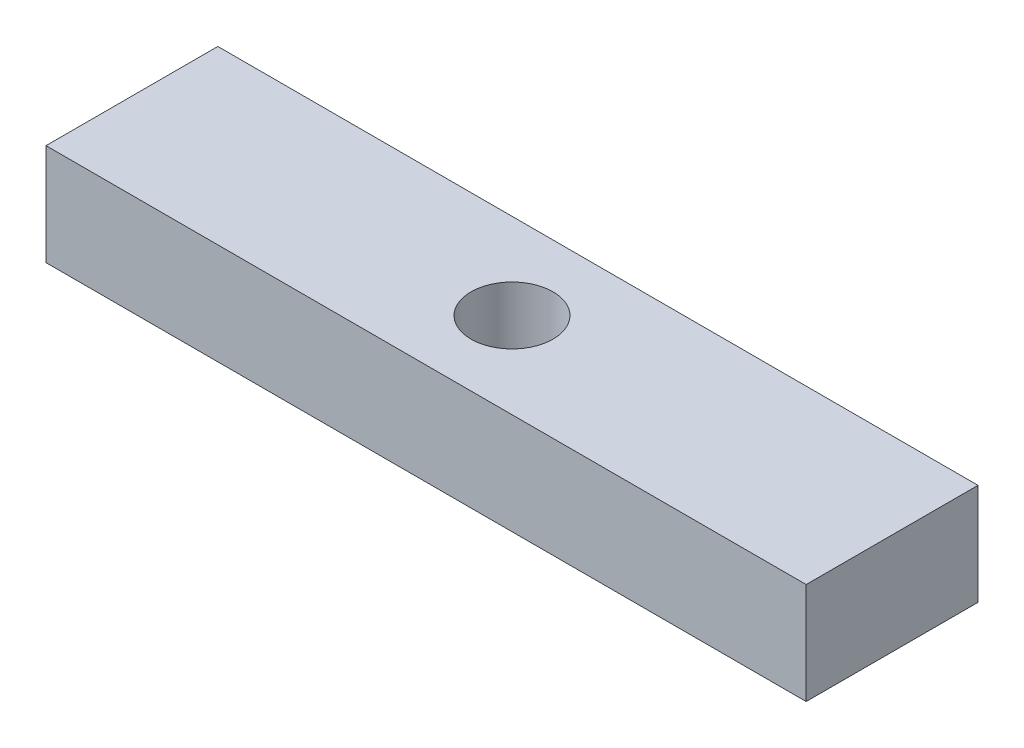
ISO-10303-21;
HEADER;
FILE_DESCRIPTION(('STEP AP214'),'2;1');
FILE_NAME('part.step','',(''),(''),'','','');
FILE_SCHEMA(('AUTOMOTIVE_DESIGN { 1 0 10303 214 1 1 1 1 }'));
ENDSEC;
DATA;
#1=APPLICATION_CONTEXT('core data for automotive mechanical design processes');
#2=APPLICATION_PROTOCOL_DEFINITION('international standard','automotive_design',2000,#1);
#3=PRODUCT_CONTEXT('',#1,'mechanical');
#4=PRODUCT('Part','Part','',(#3));
#5=PRODUCT_RELATED_PRODUCT_CATEGORY('part','',(#4));
#6=PRODUCT_DEFINITION_FORMATION('','',#4);
#7=PRODUCT_DEFINITION_CONTEXT('part definition',#1,'design');
#8=PRODUCT_DEFINITION('design','',#6,#7);
#9=PRODUCT_DEFINITION_SHAPE('','',#8);
#10=(LENGTH_UNIT() NAMED_UNIT(*) SI_UNIT(.MILLI.,.METRE.));
#11=(NAMED_UNIT(*) PLANE_ANGLE_UNIT() SI_UNIT($,.RADIAN.));
#12=(NAMED_UNIT(*) SI_UNIT($,.STERADIAN.) SOLID_ANGLE_UNIT());
#13=UNCERTAINTY_MEASURE_WITH_UNIT(LENGTH_MEASURE(1.E-05),#10,'distance_accuracy_value','');
#14=(GEOMETRIC_REPRESENTATION_CONTEXT(3) GLOBAL_UNCERTAINTY_ASSIGNED_CONTEXT((#13)) GLOBAL_UNIT_ASSIGNED_CONTEXT((#10,
#11,#12)) REPRESENTATION_CONTEXT('',''));
#15=CARTESIAN_POINT('',(0.,0.,0.));
#16=DIRECTION('',(0.,0.,1.));
#17=DIRECTION('',(1.,0.,0.));
#18=AXIS2_PLACEMENT_3D('',#15,#16,#17);
#19=CARTESIAN_POINT('',(20.0025,5.334,4.5212));
#20=DIRECTION('',(-1.,0.,0.));
#21=DIRECTION('',(0.,0.,1.));
#22=AXIS2_PLACEMENT_3D('',#19,#20,#21);
#23=PLANE('',#22);
#24=DIRECTION('',(0.,0.,-1.));
#25=VECTOR('',#24,1.);
#26=CARTESIAN_POINT('',(20.0025,0.,4.5212));
#27=LINE('',#26,#25);
#28=CARTESIAN_POINT('',(20.0025,0.,4.5212));
#29=VERTEX_POINT('',#28);
#30=CARTESIAN_POINT('',(20.0025,0.,-4.5212));
#31=VERTEX_POINT('',#30);
#32=EDGE_CURVE('E107',#29,#31,#27,.T.);
#33=ORIENTED_EDGE('',*,*,#32,.T.);
#34=DIRECTION('',(0.,-1.,0.));
#35=VECTOR('',#34,1.);
#36=CARTESIAN_POINT('',(20.0025,5.334,-4.5212));
#37=LINE('',#36,#35);
#38=CARTESIAN_POINT('',(20.0025,5.334,-4.5212));
#39=VERTEX_POINT('',#38);
#40=EDGE_CURVE('E11',#39,#31,#37,.T.);
#41=ORIENTED_EDGE('',*,*,#40,.F.);
#42=DIRECTION('',(0.,0.,-1.));
#43=VECTOR('',#42,1.);
#44=CARTESIAN_POINT('',(20.0025,5.334,4.5212));
#45=LINE('',#44,#43);
#46=CARTESIAN_POINT('',(20.0025,5.334,4.5212));
#47=VERTEX_POINT('',#46);
#48=EDGE_CURVE('E91',#47,#39,#45,.T.);
#49=ORIENTED_EDGE('',*,*,#48,.F.);
#50=DIRECTION('',(0.,-1.,0.));
#51=VECTOR('',#50,1.);
#52=CARTESIAN_POINT('',(20.0025,5.334,4.5212));
#53=LINE('',#52,#51);
#54=EDGE_CURVE('E103',#47,#29,#53,.T.);
#55=ORIENTED_EDGE('',*,*,#54,.T.);
#56=EDGE_LOOP('',(#33,#41,#49,#55));
#57=FACE_BOUND('',#56,.T.);
#58=ADVANCED_FACE('F39',(#57),#23,.F.);
#59=CARTESIAN_POINT('',(-20.0025,5.334,-4.5212));
#60=DIRECTION('',(0.,0.,1.));
#61=DIRECTION('',(1.,0.,0.));
#62=AXIS2_PLACEMENT_3D('',#59,#60,#61);
#63=PLANE('',#62);
#64=DIRECTION('',(-1.,0.,0.));
#65=VECTOR('',#64,1.);
#66=CARTESIAN_POINT('',(-20.0025,0.,-4.5212));
#67=LINE('',#66,#65);
#68=CARTESIAN_POINT('',(-20.0025,0.,-4.5212));
#69=VERTEX_POINT('',#68);
#70=EDGE_CURVE('E96',#31,#69,#67,.T.);
#71=ORIENTED_EDGE('',*,*,#70,.T.);
#72=DIRECTION('',(0.,-1.,0.));
#73=VECTOR('',#72,1.);
#74=CARTESIAN_POINT('',(-20.0025,5.334,-4.5212));
#75=LINE('',#74,#73);
#76=CARTESIAN_POINT('',(-20.0025,5.334,-4.5212));
#77=VERTEX_POINT('',#76);
#78=EDGE_CURVE('E48',#77,#69,#75,.T.);
#79=ORIENTED_EDGE('',*,*,#78,.F.);
#80=DIRECTION('',(-1.,0.,0.));
#81=VECTOR('',#80,1.);
#82=CARTESIAN_POINT('',(-20.0025,5.334,-4.5212));
#83=LINE('',#82,#81);
#84=EDGE_CURVE('E86',#39,#77,#83,.T.);
#85=ORIENTED_EDGE('',*,*,#84,.F.);
#86=ORIENTED_EDGE('',*,*,#40,.T.);
#87=EDGE_LOOP('',(#71,#79,#85,#86));
#88=FACE_BOUND('',#87,.T.);
#89=ADVANCED_FACE('F95',(#88),#63,.F.);
#90=CARTESIAN_POINT('',(-20.0025,5.334,4.5212));
#91=DIRECTION('',(1.,0.,0.));
#92=DIRECTION('',(0.,0.,-1.));
#93=AXIS2_PLACEMENT_3D('',#90,#91,#92);
#94=PLANE('',#93);
#95=DIRECTION('',(0.,0.,1.));
#96=VECTOR('',#95,1.);
#97=CARTESIAN_POINT('',(-20.0025,0.,4.5212));
#98=LINE('',#97,#96);
#99=CARTESIAN_POINT('',(-20.0025,0.,4.5212));
#100=VERTEX_POINT('',#99);
#101=EDGE_CURVE('E73',#69,#100,#98,.T.);
#102=ORIENTED_EDGE('',*,*,#101,.T.);
#103=DIRECTION('',(0.,-1.,0.));
#104=VECTOR('',#103,1.);
#105=CARTESIAN_POINT('',(-20.0025,5.334,4.5212));
#106=LINE('',#105,#104);
#107=CARTESIAN_POINT('',(-20.0025,5.334,4.5212));
#108=VERTEX_POINT('',#107);
#109=EDGE_CURVE('E98',#108,#100,#106,.T.);
#110=ORIENTED_EDGE('',*,*,#109,.F.);
#111=DIRECTION('',(0.,0.,1.));
#112=VECTOR('',#111,1.);
#113=CARTESIAN_POINT('',(-20.0025,5.334,4.5212));
#114=LINE('',#113,#112);
#115=EDGE_CURVE('E89',#77,#108,#114,.T.);
#116=ORIENTED_EDGE('',*,*,#115,.F.);
#117=ORIENTED_EDGE('',*,*,#78,.T.);
#118=EDGE_LOOP('',(#102,#110,#116,#117));
#119=FACE_BOUND('',#118,.T.);
#120=ADVANCED_FACE('F99',(#119),#94,.F.);
#121=CARTESIAN_POINT('',(-20.0025,5.334,4.5212));
#122=DIRECTION('',(0.,0.,-1.));
#123=DIRECTION('',(-1.,0.,0.));
#124=AXIS2_PLACEMENT_3D('',#121,#122,#123);
#125=PLANE('',#124);
#126=DIRECTION('',(1.,0.,0.));
#127=VECTOR('',#126,1.);
#128=CARTESIAN_POINT('',(-20.0025,0.,4.5212));
#129=LINE('',#128,#127);
#130=EDGE_CURVE('E79',#100,#29,#129,.T.);
#131=ORIENTED_EDGE('',*,*,#130,.T.);
#132=ORIENTED_EDGE('',*,*,#54,.F.);
#133=DIRECTION('',(1.,0.,0.));
#134=VECTOR('',#133,1.);
#135=CARTESIAN_POINT('',(-20.0025,5.334,4.5212));
#136=LINE('',#135,#134);
#137=EDGE_CURVE('E56',#108,#47,#136,.T.);
#138=ORIENTED_EDGE('',*,*,#137,.F.);
#139=ORIENTED_EDGE('',*,*,#109,.T.);
#140=EDGE_LOOP('',(#131,#132,#138,#139));
#141=FACE_BOUND('',#140,.T.);
#142=ADVANCED_FACE('F121',(#141),#125,.F.);
#143=CARTESIAN_POINT('',(0.,5.334,0.));
#144=DIRECTION('',(0.,-1.,0.));
#145=DIRECTION('',(0.,0.,-1.));
#146=AXIS2_PLACEMENT_3D('',#143,#144,#145);
#147=PLANE('',#146);
#148=CARTESIAN_POINT('',(0.,5.334,0.));
#149=DIRECTION('',(0.,1.,0.));
#150=DIRECTION('',(0.,0.,1.));
#151=AXIS2_PLACEMENT_3D('',#148,#149,#150);
#152=CIRCLE('',#151,2.159);
#153=CARTESIAN_POINT('',(0.,5.334,2.159));
#154=VERTEX_POINT('',#153);
#155=EDGE_CURVE('E128',#154,#154,#152,.T.);
#156=ORIENTED_EDGE('',*,*,#155,.F.);
#157=EDGE_LOOP('',(#156));
#158=FACE_BOUND('',#157,.T.);
#159=ORIENTED_EDGE('',*,*,#48,.T.);
#160=ORIENTED_EDGE('',*,*,#84,.T.);
#161=ORIENTED_EDGE('',*,*,#115,.T.);
#162=ORIENTED_EDGE('',*,*,#137,.T.);
#163=EDGE_LOOP('',(#159,#160,#161,#162));
#164=FACE_BOUND('',#163,.T.);
#165=ADVANCED_FACE('F87',(#158,#164),#147,.F.);
#166=CARTESIAN_POINT('',(0.,0.,0.));
#167=DIRECTION('',(0.,-1.,0.));
#168=DIRECTION('',(0.,0.,-1.));
#169=AXIS2_PLACEMENT_3D('',#166,#167,#168);
#170=PLANE('',#169);
#171=CARTESIAN_POINT('',(0.,0.,0.));
#172=DIRECTION('',(0.,1.,0.));
#173=DIRECTION('',(0.,0.,1.));
#174=AXIS2_PLACEMENT_3D('',#171,#172,#173);
#175=CIRCLE('',#174,2.159);
#176=CARTESIAN_POINT('',(0.,0.,2.159));
#177=VERTEX_POINT('',#176);
#178=EDGE_CURVE('E111',#177,#177,#175,.T.);
#179=ORIENTED_EDGE('',*,*,#178,.T.);
#180=EDGE_LOOP('',(#179));
#181=FACE_BOUND('',#180,.T.);
#182=ORIENTED_EDGE('',*,*,#32,.F.);
#183=ORIENTED_EDGE('',*,*,#130,.F.);
#184=ORIENTED_EDGE('',*,*,#101,.F.);
#185=ORIENTED_EDGE('',*,*,#70,.F.);
#186=EDGE_LOOP('',(#182,#183,#184,#185));
#187=FACE_BOUND('',#186,.T.);
#188=ADVANCED_FACE('F124',(#181,#187),#170,.T.);
#189=CARTESIAN_POINT('',(0.,0.,0.));
#190=DIRECTION('',(0.,1.,0.));
#191=DIRECTION('',(0.,0.,1.));
#192=AXIS2_PLACEMENT_3D('',#189,#190,#191);
#193=CYLINDRICAL_SURFACE('',#192,2.159);
#194=ORIENTED_EDGE('',*,*,#178,.F.);
#195=EDGE_LOOP('',(#194));
#196=FACE_BOUND('',#195,.T.);
#197=ORIENTED_EDGE('',*,*,#155,.T.);
#198=EDGE_LOOP('',(#197));
#199=FACE_BOUND('',#198,.T.);
#200=ADVANCED_FACE('F137',(#196,#199),#193,.F.);
#201=CLOSED_SHELL('',(#58,#89,#120,#142,#165,#188,#200));
#202=MANIFOLD_SOLID_BREP('B2',#201);
#203=ADVANCED_BREP_SHAPE_REPRESENTATION('',(#18,#202),#14);
#204=SHAPE_DEFINITION_REPRESENTATION(#9,#203);
ENDSEC;
END-ISO-10303-21;
